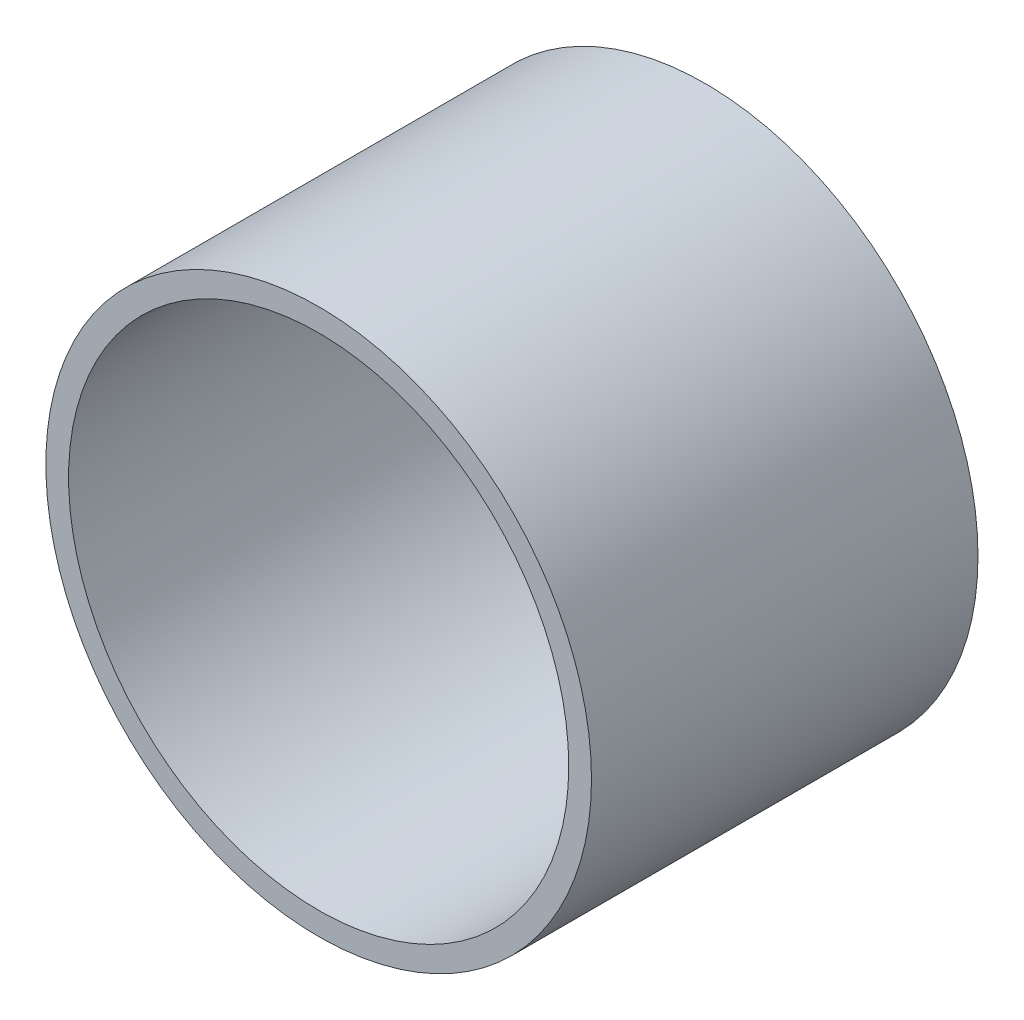
ISO-10303-21;
HEADER;
FILE_DESCRIPTION(('STEP AP214'),'2;1');
FILE_NAME('part.step','',(''),(''),'','','');
FILE_SCHEMA(('AUTOMOTIVE_DESIGN { 1 0 10303 214 1 1 1 1 }'));
ENDSEC;
DATA;
#1=APPLICATION_CONTEXT('core data for automotive mechanical design processes');
#2=APPLICATION_PROTOCOL_DEFINITION('international standard','automotive_design',2000,#1);
#3=PRODUCT_CONTEXT('',#1,'mechanical');
#4=PRODUCT('Part','Part','',(#3));
#5=PRODUCT_RELATED_PRODUCT_CATEGORY('part','',(#4));
#6=PRODUCT_DEFINITION_FORMATION('','',#4);
#7=PRODUCT_DEFINITION_CONTEXT('part definition',#1,'design');
#8=PRODUCT_DEFINITION('design','',#6,#7);
#9=PRODUCT_DEFINITION_SHAPE('','',#8);
#10=(LENGTH_UNIT() NAMED_UNIT(*) SI_UNIT(.MILLI.,.METRE.));
#11=(NAMED_UNIT(*) PLANE_ANGLE_UNIT() SI_UNIT($,.RADIAN.));
#12=(NAMED_UNIT(*) SI_UNIT($,.STERADIAN.) SOLID_ANGLE_UNIT());
#13=UNCERTAINTY_MEASURE_WITH_UNIT(LENGTH_MEASURE(1.E-05),#10,'distance_accuracy_value','');
#14=(GEOMETRIC_REPRESENTATION_CONTEXT(3) GLOBAL_UNCERTAINTY_ASSIGNED_CONTEXT((#13)) GLOBAL_UNIT_ASSIGNED_CONTEXT((#10,
#11,#12)) REPRESENTATION_CONTEXT('',''));
#15=CARTESIAN_POINT('',(0.,0.,0.));
#16=DIRECTION('',(0.,0.,1.));
#17=DIRECTION('',(1.,0.,0.));
#18=AXIS2_PLACEMENT_3D('',#15,#16,#17);
#19=CARTESIAN_POINT('',(0.,0.,6.35));
#20=DIRECTION('',(0.,0.,1.));
#21=DIRECTION('',(1.,0.,0.));
#22=AXIS2_PLACEMENT_3D('',#19,#20,#21);
#23=PLANE('',#22);
#24=CARTESIAN_POINT('',(35.9210244842765,35.9210244842768,6.35));
#25=DIRECTION('',(0.,0.,1.));
#26=DIRECTION('',(1.,0.,0.));
#27=AXIS2_PLACEMENT_3D('',#24,#25,#26);
#28=CIRCLE('',#27,2.1828125);
#29=CARTESIAN_POINT('',(38.1038369842765,35.9210244842768,6.35));
#30=VERTEX_POINT('',#29);
#31=EDGE_CURVE('E150',#30,#30,#28,.T.);
#32=ORIENTED_EDGE('',*,*,#31,.F.);
#33=EDGE_LOOP('',(#32));
#34=FACE_BOUND('',#33,.T.);
#35=CARTESIAN_POINT('',(35.9210244842767,-35.9210244842765,6.35));
#36=DIRECTION('',(0.,0.,1.));
#37=DIRECTION('',(1.,0.,0.));
#38=AXIS2_PLACEMENT_3D('',#35,#36,#37);
#39=CIRCLE('',#38,2.18281250000001);
#40=CARTESIAN_POINT('',(38.1038369842767,-35.9210244842765,6.35));
#41=VERTEX_POINT('',#40);
#42=EDGE_CURVE('E142',#41,#41,#39,.T.);
#43=ORIENTED_EDGE('',*,*,#42,.F.);
#44=EDGE_LOOP('',(#43));
#45=FACE_BOUND('',#44,.T.);
#46=CARTESIAN_POINT('',(-35.9210244842765,-35.9210244842768,6.35));
#47=DIRECTION('',(0.,0.,1.));
#48=DIRECTION('',(1.,0.,0.));
#49=AXIS2_PLACEMENT_3D('',#46,#47,#48);
#50=CIRCLE('',#49,2.18281250000001);
#51=CARTESIAN_POINT('',(-33.7382119842765,-35.9210244842768,6.35));
#52=VERTEX_POINT('',#51);
#53=EDGE_CURVE('E133',#52,#52,#50,.T.);
#54=ORIENTED_EDGE('',*,*,#53,.F.);
#55=EDGE_LOOP('',(#54));
#56=FACE_BOUND('',#55,.T.);
#57=CARTESIAN_POINT('',(-35.9210244842768,35.9210244842765,6.35));
#58=DIRECTION('',(0.,0.,1.));
#59=DIRECTION('',(1.,0.,0.));
#60=AXIS2_PLACEMENT_3D('',#57,#58,#59);
#61=CIRCLE('',#60,2.18281250000001);
#62=CARTESIAN_POINT('',(-33.7382119842768,35.9210244842765,6.35));
#63=VERTEX_POINT('',#62);
#64=EDGE_CURVE('E137',#63,#63,#61,.T.);
#65=ORIENTED_EDGE('',*,*,#64,.F.);
#66=EDGE_LOOP('',(#65));
#67=FACE_BOUND('',#66,.T.);
#68=CARTESIAN_POINT('',(37.81298,0.,6.35));
#69=DIRECTION('',(0.,0.,1.));
#70=DIRECTION('',(1.,0.,0.));
#71=AXIS2_PLACEMENT_3D('',#68,#69,#70);
#72=CIRCLE('',#71,2.1828125);
#73=CARTESIAN_POINT('',(39.9957925,0.,6.35));
#74=VERTEX_POINT('',#73);
#75=EDGE_CURVE('E170',#74,#74,#72,.T.);
#76=ORIENTED_EDGE('',*,*,#75,.F.);
#77=EDGE_LOOP('',(#76));
#78=FACE_BOUND('',#77,.T.);
#79=CARTESIAN_POINT('',(0.,37.81298,6.35));
#80=DIRECTION('',(0.,0.,1.));
#81=DIRECTION('',(1.,0.,0.));
#82=AXIS2_PLACEMENT_3D('',#79,#80,#81);
#83=CIRCLE('',#82,2.1828125);
#84=CARTESIAN_POINT('',(2.1828125,37.81298,6.35));
#85=VERTEX_POINT('',#84);
#86=EDGE_CURVE('E174',#85,#85,#83,.T.);
#87=ORIENTED_EDGE('',*,*,#86,.F.);
#88=EDGE_LOOP('',(#87));
#89=FACE_BOUND('',#88,.T.);
#90=CARTESIAN_POINT('',(-37.81298,0.,6.35));
#91=DIRECTION('',(0.,0.,1.));
#92=DIRECTION('',(1.,0.,0.));
#93=AXIS2_PLACEMENT_3D('',#90,#91,#92);
#94=CIRCLE('',#93,2.1828125);
#95=CARTESIAN_POINT('',(-35.6301675,0.,6.35));
#96=VERTEX_POINT('',#95);
#97=EDGE_CURVE('E182',#96,#96,#94,.T.);
#98=ORIENTED_EDGE('',*,*,#97,.F.);
#99=EDGE_LOOP('',(#98));
#100=FACE_BOUND('',#99,.T.);
#101=CARTESIAN_POINT('',(0.,-37.81298,6.35));
#102=DIRECTION('',(0.,0.,1.));
#103=DIRECTION('',(1.,0.,0.));
#104=AXIS2_PLACEMENT_3D('',#101,#102,#103);
#105=CIRCLE('',#104,2.1828125);
#106=CARTESIAN_POINT('',(2.1828125,-37.81298,6.35));
#107=VERTEX_POINT('',#106);
#108=EDGE_CURVE('E190',#107,#107,#105,.T.);
#109=ORIENTED_EDGE('',*,*,#108,.F.);
#110=EDGE_LOOP('',(#109));
#111=FACE_BOUND('',#110,.T.);
#112=CARTESIAN_POINT('',(0.,0.,6.34999999999999));
#113=DIRECTION('',(0.,0.,1.));
#114=DIRECTION('',(1.,0.,0.));
#115=AXIS2_PLACEMENT_3D('',#112,#113,#114);
#116=CIRCLE('',#115,69.85);
#117=CARTESIAN_POINT('',(69.85,0.,6.34999999999999));
#118=VERTEX_POINT('',#117);
#119=EDGE_CURVE('E11',#118,#118,#116,.T.);
#120=ORIENTED_EDGE('',*,*,#119,.T.);
#121=EDGE_LOOP('',(#120));
#122=FACE_BOUND('',#121,.T.);
#123=DIRECTION('',(1.,0.,0.));
#124=VECTOR('',#123,1.);
#125=CARTESIAN_POINT('',(-19.05,-19.05,6.35));
#126=LINE('',#125,#124);
#127=CARTESIAN_POINT('',(-19.05,-19.05,6.35));
#128=VERTEX_POINT('',#127);
#129=CARTESIAN_POINT('',(19.05,-19.05,6.35));
#130=VERTEX_POINT('',#129);
#131=EDGE_CURVE('E101',#128,#130,#126,.T.);
#132=ORIENTED_EDGE('',*,*,#131,.F.);
#133=DIRECTION('',(0.,-1.,0.));
#134=VECTOR('',#133,1.);
#135=CARTESIAN_POINT('',(-19.05,19.05,6.35));
#136=LINE('',#135,#134);
#137=CARTESIAN_POINT('',(-19.05,19.05,6.35));
#138=VERTEX_POINT('',#137);
#139=EDGE_CURVE('E115',#138,#128,#136,.T.);
#140=ORIENTED_EDGE('',*,*,#139,.F.);
#141=DIRECTION('',(-1.,0.,0.));
#142=VECTOR('',#141,1.);
#143=CARTESIAN_POINT('',(-19.05,19.05,6.35));
#144=LINE('',#143,#142);
#145=CARTESIAN_POINT('',(19.05,19.05,6.35));
#146=VERTEX_POINT('',#145);
#147=EDGE_CURVE('E81',#146,#138,#144,.T.);
#148=ORIENTED_EDGE('',*,*,#147,.F.);
#149=DIRECTION('',(0.,1.,0.));
#150=VECTOR('',#149,1.);
#151=CARTESIAN_POINT('',(19.05,19.05,6.35));
#152=LINE('',#151,#150);
#153=EDGE_CURVE('E121',#130,#146,#152,.T.);
#154=ORIENTED_EDGE('',*,*,#153,.F.);
#155=EDGE_LOOP('',(#132,#140,#148,#154));
#156=FACE_BOUND('',#155,.T.);
#157=ADVANCED_FACE('F43',(#34,#45,#56,#67,#78,#89,#100,#111,#122,#156),#23,.T.);
#158=CARTESIAN_POINT('',(0.,0.,107.95));
#159=DIRECTION('',(0.,0.,1.));
#160=DIRECTION('',(1.,0.,0.));
#161=AXIS2_PLACEMENT_3D('',#158,#159,#160);
#162=PLANE('',#161);
#163=CARTESIAN_POINT('',(0.,0.,107.95));
#164=DIRECTION('',(0.,0.,1.));
#165=DIRECTION('',(1.,0.,0.));
#166=AXIS2_PLACEMENT_3D('',#163,#164,#165);
#167=CIRCLE('',#166,76.2);
#168=CARTESIAN_POINT('',(76.2,0.,107.95));
#169=VERTEX_POINT('',#168);
#170=EDGE_CURVE('E52',#169,#169,#167,.T.);
#171=ORIENTED_EDGE('',*,*,#170,.T.);
#172=EDGE_LOOP('',(#171));
#173=FACE_BOUND('',#172,.T.);
#174=CARTESIAN_POINT('',(0.,0.,107.95));
#175=DIRECTION('',(0.,0.,1.));
#176=DIRECTION('',(1.,0.,0.));
#177=AXIS2_PLACEMENT_3D('',#174,#175,#176);
#178=CIRCLE('',#177,69.85);
#179=CARTESIAN_POINT('',(69.85,0.,107.95));
#180=VERTEX_POINT('',#179);
#181=EDGE_CURVE('E169',#180,#180,#178,.T.);
#182=ORIENTED_EDGE('',*,*,#181,.F.);
#183=EDGE_LOOP('',(#182));
#184=FACE_BOUND('',#183,.T.);
#185=ADVANCED_FACE('F210',(#173,#184),#162,.T.);
#186=CARTESIAN_POINT('',(0.,0.,0.));
#187=DIRECTION('',(0.,0.,1.));
#188=DIRECTION('',(1.,0.,0.));
#189=AXIS2_PLACEMENT_3D('',#186,#187,#188);
#190=PLANE('',#189);
#191=CARTESIAN_POINT('',(35.9210244842765,35.9210244842768,0.));
#192=DIRECTION('',(0.,0.,1.));
#193=DIRECTION('',(1.,0.,0.));
#194=AXIS2_PLACEMENT_3D('',#191,#192,#193);
#195=CIRCLE('',#194,2.1828125);
#196=CARTESIAN_POINT('',(38.1038369842765,35.9210244842768,0.));
#197=VERTEX_POINT('',#196);
#198=EDGE_CURVE('E132',#197,#197,#195,.T.);
#199=ORIENTED_EDGE('',*,*,#198,.T.);
#200=EDGE_LOOP('',(#199));
#201=FACE_BOUND('',#200,.T.);
#202=CARTESIAN_POINT('',(35.9210244842767,-35.9210244842765,0.));
#203=DIRECTION('',(0.,0.,1.));
#204=DIRECTION('',(1.,0.,0.));
#205=AXIS2_PLACEMENT_3D('',#202,#203,#204);
#206=CIRCLE('',#205,2.18281250000001);
#207=CARTESIAN_POINT('',(38.1038369842767,-35.9210244842765,0.));
#208=VERTEX_POINT('',#207);
#209=EDGE_CURVE('E146',#208,#208,#206,.T.);
#210=ORIENTED_EDGE('',*,*,#209,.T.);
#211=EDGE_LOOP('',(#210));
#212=FACE_BOUND('',#211,.T.);
#213=CARTESIAN_POINT('',(-35.9210244842765,-35.9210244842768,0.));
#214=DIRECTION('',(0.,0.,1.));
#215=DIRECTION('',(1.,0.,0.));
#216=AXIS2_PLACEMENT_3D('',#213,#214,#215);
#217=CIRCLE('',#216,2.18281250000001);
#218=CARTESIAN_POINT('',(-33.7382119842765,-35.9210244842768,0.));
#219=VERTEX_POINT('',#218);
#220=EDGE_CURVE('E138',#219,#219,#217,.T.);
#221=ORIENTED_EDGE('',*,*,#220,.T.);
#222=EDGE_LOOP('',(#221));
#223=FACE_BOUND('',#222,.T.);
#224=CARTESIAN_POINT('',(-35.9210244842768,35.9210244842765,0.));
#225=DIRECTION('',(0.,0.,1.));
#226=DIRECTION('',(1.,0.,0.));
#227=AXIS2_PLACEMENT_3D('',#224,#225,#226);
#228=CIRCLE('',#227,2.18281250000001);
#229=CARTESIAN_POINT('',(-33.7382119842768,35.9210244842765,0.));
#230=VERTEX_POINT('',#229);
#231=EDGE_CURVE('E157',#230,#230,#228,.T.);
#232=ORIENTED_EDGE('',*,*,#231,.T.);
#233=EDGE_LOOP('',(#232));
#234=FACE_BOUND('',#233,.T.);
#235=CARTESIAN_POINT('',(37.81298,0.,0.));
#236=DIRECTION('',(0.,0.,1.));
#237=DIRECTION('',(1.,0.,0.));
#238=AXIS2_PLACEMENT_3D('',#235,#236,#237);
#239=CIRCLE('',#238,2.1828125);
#240=CARTESIAN_POINT('',(39.9957925,0.,0.));
#241=VERTEX_POINT('',#240);
#242=EDGE_CURVE('E165',#241,#241,#239,.T.);
#243=ORIENTED_EDGE('',*,*,#242,.T.);
#244=EDGE_LOOP('',(#243));
#245=FACE_BOUND('',#244,.T.);
#246=CARTESIAN_POINT('',(0.,37.81298,0.));
#247=DIRECTION('',(0.,0.,1.));
#248=DIRECTION('',(1.,0.,0.));
#249=AXIS2_PLACEMENT_3D('',#246,#247,#248);
#250=CIRCLE('',#249,2.1828125);
#251=CARTESIAN_POINT('',(2.1828125,37.81298,0.));
#252=VERTEX_POINT('',#251);
#253=EDGE_CURVE('E178',#252,#252,#250,.T.);
#254=ORIENTED_EDGE('',*,*,#253,.T.);
#255=EDGE_LOOP('',(#254));
#256=FACE_BOUND('',#255,.T.);
#257=CARTESIAN_POINT('',(-37.81298,0.,0.));
#258=DIRECTION('',(0.,0.,1.));
#259=DIRECTION('',(1.,0.,0.));
#260=AXIS2_PLACEMENT_3D('',#257,#258,#259);
#261=CIRCLE('',#260,2.1828125);
#262=CARTESIAN_POINT('',(-35.6301675,0.,0.));
#263=VERTEX_POINT('',#262);
#264=EDGE_CURVE('E186',#263,#263,#261,.T.);
#265=ORIENTED_EDGE('',*,*,#264,.T.);
#266=EDGE_LOOP('',(#265));
#267=FACE_BOUND('',#266,.T.);
#268=CARTESIAN_POINT('',(0.,-37.81298,0.));
#269=DIRECTION('',(0.,0.,1.));
#270=DIRECTION('',(1.,0.,0.));
#271=AXIS2_PLACEMENT_3D('',#268,#269,#270);
#272=CIRCLE('',#271,2.1828125);
#273=CARTESIAN_POINT('',(2.1828125,-37.81298,0.));
#274=VERTEX_POINT('',#273);
#275=EDGE_CURVE('E161',#274,#274,#272,.T.);
#276=ORIENTED_EDGE('',*,*,#275,.T.);
#277=EDGE_LOOP('',(#276));
#278=FACE_BOUND('',#277,.T.);
#279=CARTESIAN_POINT('',(0.,0.,0.));
#280=DIRECTION('',(0.,0.,1.));
#281=DIRECTION('',(1.,0.,0.));
#282=AXIS2_PLACEMENT_3D('',#279,#280,#281);
#283=CIRCLE('',#282,76.2);
#284=CARTESIAN_POINT('',(76.2,0.,0.));
#285=VERTEX_POINT('',#284);
#286=EDGE_CURVE('E200',#285,#285,#283,.T.);
#287=ORIENTED_EDGE('',*,*,#286,.F.);
#288=EDGE_LOOP('',(#287));
#289=FACE_BOUND('',#288,.T.);
#290=ADVANCED_FACE('F208',(#201,#212,#223,#234,#245,#256,#267,#278,#289),#190,.F.);
#291=CARTESIAN_POINT('',(0.,0.,107.95));
#292=DIRECTION('',(0.,0.,-1.));
#293=DIRECTION('',(-1.,0.,0.));
#294=AXIS2_PLACEMENT_3D('',#291,#292,#293);
#295=CYLINDRICAL_SURFACE('',#294,76.2);
#296=ORIENTED_EDGE('',*,*,#170,.F.);
#297=EDGE_LOOP('',(#296));
#298=FACE_BOUND('',#297,.T.);
#299=ORIENTED_EDGE('',*,*,#286,.T.);
#300=EDGE_LOOP('',(#299));
#301=FACE_BOUND('',#300,.T.);
#302=ADVANCED_FACE('F45',(#298,#301),#295,.T.);
#303=CARTESIAN_POINT('',(0.,0.,107.95));
#304=DIRECTION('',(0.,0.,-1.));
#305=DIRECTION('',(-1.,0.,0.));
#306=AXIS2_PLACEMENT_3D('',#303,#304,#305);
#307=CYLINDRICAL_SURFACE('',#306,69.85);
#308=ORIENTED_EDGE('',*,*,#119,.F.);
#309=EDGE_LOOP('',(#308));
#310=FACE_BOUND('',#309,.T.);
#311=ORIENTED_EDGE('',*,*,#181,.T.);
#312=EDGE_LOOP('',(#311));
#313=FACE_BOUND('',#312,.T.);
#314=ADVANCED_FACE('F216',(#310,#313),#307,.F.);
#315=CARTESIAN_POINT('',(0.,-37.81298,0.));
#316=DIRECTION('',(0.,0.,1.));
#317=DIRECTION('',(1.,0.,0.));
#318=AXIS2_PLACEMENT_3D('',#315,#316,#317);
#319=CYLINDRICAL_SURFACE('',#318,2.1828125);
#320=ORIENTED_EDGE('',*,*,#275,.F.);
#321=EDGE_LOOP('',(#320));
#322=FACE_BOUND('',#321,.T.);
#323=ORIENTED_EDGE('',*,*,#108,.T.);
#324=EDGE_LOOP('',(#323));
#325=FACE_BOUND('',#324,.T.);
#326=ADVANCED_FACE('F230',(#322,#325),#319,.F.);
#327=CARTESIAN_POINT('',(-37.81298,0.,0.));
#328=DIRECTION('',(0.,0.,1.));
#329=DIRECTION('',(1.,0.,0.));
#330=AXIS2_PLACEMENT_3D('',#327,#328,#329);
#331=CYLINDRICAL_SURFACE('',#330,2.1828125);
#332=ORIENTED_EDGE('',*,*,#264,.F.);
#333=EDGE_LOOP('',(#332));
#334=FACE_BOUND('',#333,.T.);
#335=ORIENTED_EDGE('',*,*,#97,.T.);
#336=EDGE_LOOP('',(#335));
#337=FACE_BOUND('',#336,.T.);
#338=ADVANCED_FACE('F237',(#334,#337),#331,.F.);
#339=CARTESIAN_POINT('',(0.,37.81298,0.));
#340=DIRECTION('',(0.,0.,1.));
#341=DIRECTION('',(1.,0.,0.));
#342=AXIS2_PLACEMENT_3D('',#339,#340,#341);
#343=CYLINDRICAL_SURFACE('',#342,2.1828125);
#344=ORIENTED_EDGE('',*,*,#253,.F.);
#345=EDGE_LOOP('',(#344));
#346=FACE_BOUND('',#345,.T.);
#347=ORIENTED_EDGE('',*,*,#86,.T.);
#348=EDGE_LOOP('',(#347));
#349=FACE_BOUND('',#348,.T.);
#350=ADVANCED_FACE('F281',(#346,#349),#343,.F.);
#351=CARTESIAN_POINT('',(37.81298,0.,0.));
#352=DIRECTION('',(0.,0.,1.));
#353=DIRECTION('',(1.,0.,0.));
#354=AXIS2_PLACEMENT_3D('',#351,#352,#353);
#355=CYLINDRICAL_SURFACE('',#354,2.1828125);
#356=ORIENTED_EDGE('',*,*,#242,.F.);
#357=EDGE_LOOP('',(#356));
#358=FACE_BOUND('',#357,.T.);
#359=ORIENTED_EDGE('',*,*,#75,.T.);
#360=EDGE_LOOP('',(#359));
#361=FACE_BOUND('',#360,.T.);
#362=ADVANCED_FACE('F277',(#358,#361),#355,.F.);
#363=CARTESIAN_POINT('',(-35.9210244842768,35.9210244842765,0.));
#364=DIRECTION('',(0.,0.,1.));
#365=DIRECTION('',(1.,0.,0.));
#366=AXIS2_PLACEMENT_3D('',#363,#364,#365);
#367=CYLINDRICAL_SURFACE('',#366,2.18281250000001);
#368=ORIENTED_EDGE('',*,*,#231,.F.);
#369=EDGE_LOOP('',(#368));
#370=FACE_BOUND('',#369,.T.);
#371=ORIENTED_EDGE('',*,*,#64,.T.);
#372=EDGE_LOOP('',(#371));
#373=FACE_BOUND('',#372,.T.);
#374=ADVANCED_FACE('F267',(#370,#373),#367,.F.);
#375=CARTESIAN_POINT('',(-35.9210244842765,-35.9210244842768,0.));
#376=DIRECTION('',(0.,0.,1.));
#377=DIRECTION('',(1.,0.,0.));
#378=AXIS2_PLACEMENT_3D('',#375,#376,#377);
#379=CYLINDRICAL_SURFACE('',#378,2.18281250000001);
#380=ORIENTED_EDGE('',*,*,#220,.F.);
#381=EDGE_LOOP('',(#380));
#382=FACE_BOUND('',#381,.T.);
#383=ORIENTED_EDGE('',*,*,#53,.T.);
#384=EDGE_LOOP('',(#383));
#385=FACE_BOUND('',#384,.T.);
#386=ADVANCED_FACE('F263',(#382,#385),#379,.F.);
#387=CARTESIAN_POINT('',(35.9210244842767,-35.9210244842765,0.));
#388=DIRECTION('',(0.,0.,1.));
#389=DIRECTION('',(1.,0.,0.));
#390=AXIS2_PLACEMENT_3D('',#387,#388,#389);
#391=CYLINDRICAL_SURFACE('',#390,2.18281250000001);
#392=ORIENTED_EDGE('',*,*,#209,.F.);
#393=EDGE_LOOP('',(#392));
#394=FACE_BOUND('',#393,.T.);
#395=ORIENTED_EDGE('',*,*,#42,.T.);
#396=EDGE_LOOP('',(#395));
#397=FACE_BOUND('',#396,.T.);
#398=ADVANCED_FACE('F266',(#394,#397),#391,.F.);
#399=CARTESIAN_POINT('',(35.9210244842765,35.9210244842768,0.));
#400=DIRECTION('',(0.,0.,1.));
#401=DIRECTION('',(1.,0.,0.));
#402=AXIS2_PLACEMENT_3D('',#399,#400,#401);
#403=CYLINDRICAL_SURFACE('',#402,2.1828125);
#404=ORIENTED_EDGE('',*,*,#198,.F.);
#405=EDGE_LOOP('',(#404));
#406=FACE_BOUND('',#405,.T.);
#407=ORIENTED_EDGE('',*,*,#31,.T.);
#408=EDGE_LOOP('',(#407));
#409=FACE_BOUND('',#408,.T.);
#410=ADVANCED_FACE('F262',(#406,#409),#403,.F.);
#411=CARTESIAN_POINT('',(-19.05,19.05,25.4));
#412=DIRECTION('',(1.,0.,0.));
#413=DIRECTION('',(0.,1.,0.));
#414=AXIS2_PLACEMENT_3D('',#411,#412,#413);
#415=PLANE('',#414);
#416=ORIENTED_EDGE('',*,*,#139,.T.);
#417=DIRECTION('',(0.,0.,-1.));
#418=VECTOR('',#417,1.);
#419=CARTESIAN_POINT('',(-19.05,-19.05,25.4));
#420=LINE('',#419,#418);
#421=CARTESIAN_POINT('',(-19.05,-19.05,25.4));
#422=VERTEX_POINT('',#421);
#423=EDGE_CURVE('E105',#422,#128,#420,.T.);
#424=ORIENTED_EDGE('',*,*,#423,.F.);
#425=DIRECTION('',(0.,-1.,0.));
#426=VECTOR('',#425,1.);
#427=CARTESIAN_POINT('',(-19.05,19.05,25.4));
#428=LINE('',#427,#426);
#429=CARTESIAN_POINT('',(-19.05,19.05,25.4));
#430=VERTEX_POINT('',#429);
#431=EDGE_CURVE('E93',#430,#422,#428,.T.);
#432=ORIENTED_EDGE('',*,*,#431,.F.);
#433=DIRECTION('',(0.,0.,-1.));
#434=VECTOR('',#433,1.);
#435=CARTESIAN_POINT('',(-19.05,19.05,25.4));
#436=LINE('',#435,#434);
#437=EDGE_CURVE('E111',#430,#138,#436,.T.);
#438=ORIENTED_EDGE('',*,*,#437,.T.);
#439=EDGE_LOOP('',(#416,#424,#432,#438));
#440=FACE_BOUND('',#439,.T.);
#441=ADVANCED_FACE('F247',(#440),#415,.F.);
#442=CARTESIAN_POINT('',(-19.05,-19.05,25.4));
#443=DIRECTION('',(0.,1.,0.));
#444=DIRECTION('',(0.,0.,1.));
#445=AXIS2_PLACEMENT_3D('',#442,#443,#444);
#446=PLANE('',#445);
#447=ORIENTED_EDGE('',*,*,#131,.T.);
#448=DIRECTION('',(0.,0.,-1.));
#449=VECTOR('',#448,1.);
#450=CARTESIAN_POINT('',(19.05,-19.05,25.4));
#451=LINE('',#450,#449);
#452=CARTESIAN_POINT('',(19.05,-19.05,25.4));
#453=VERTEX_POINT('',#452);
#454=EDGE_CURVE('E98',#453,#130,#451,.T.);
#455=ORIENTED_EDGE('',*,*,#454,.F.);
#456=DIRECTION('',(1.,0.,0.));
#457=VECTOR('',#456,1.);
#458=CARTESIAN_POINT('',(-19.05,-19.05,25.4));
#459=LINE('',#458,#457);
#460=EDGE_CURVE('E88',#422,#453,#459,.T.);
#461=ORIENTED_EDGE('',*,*,#460,.F.);
#462=ORIENTED_EDGE('',*,*,#423,.T.);
#463=EDGE_LOOP('',(#447,#455,#461,#462));
#464=FACE_BOUND('',#463,.T.);
#465=ADVANCED_FACE('F99',(#464),#446,.F.);
#466=CARTESIAN_POINT('',(19.05,19.05,25.4));
#467=DIRECTION('',(-1.,0.,0.));
#468=DIRECTION('',(0.,0.,1.));
#469=AXIS2_PLACEMENT_3D('',#466,#467,#468);
#470=PLANE('',#469);
#471=ORIENTED_EDGE('',*,*,#153,.T.);
#472=DIRECTION('',(0.,0.,-1.));
#473=VECTOR('',#472,1.);
#474=CARTESIAN_POINT('',(19.05,19.05,25.4));
#475=LINE('',#474,#473);
#476=CARTESIAN_POINT('',(19.05,19.05,25.4));
#477=VERTEX_POINT('',#476);
#478=EDGE_CURVE('E59',#477,#146,#475,.T.);
#479=ORIENTED_EDGE('',*,*,#478,.F.);
#480=DIRECTION('',(0.,1.,0.));
#481=VECTOR('',#480,1.);
#482=CARTESIAN_POINT('',(19.05,19.05,25.4));
#483=LINE('',#482,#481);
#484=EDGE_CURVE('E91',#453,#477,#483,.T.);
#485=ORIENTED_EDGE('',*,*,#484,.F.);
#486=ORIENTED_EDGE('',*,*,#454,.T.);
#487=EDGE_LOOP('',(#471,#479,#485,#486));
#488=FACE_BOUND('',#487,.T.);
#489=ADVANCED_FACE('F107',(#488),#470,.F.);
#490=CARTESIAN_POINT('',(-19.05,19.05,25.4));
#491=DIRECTION('',(0.,-1.,0.));
#492=DIRECTION('',(0.,0.,-1.));
#493=AXIS2_PLACEMENT_3D('',#490,#491,#492);
#494=PLANE('',#493);
#495=ORIENTED_EDGE('',*,*,#147,.T.);
#496=ORIENTED_EDGE('',*,*,#437,.F.);
#497=DIRECTION('',(-1.,0.,0.));
#498=VECTOR('',#497,1.);
#499=CARTESIAN_POINT('',(-19.05,19.05,25.4));
#500=LINE('',#499,#498);
#501=EDGE_CURVE('E67',#477,#430,#500,.T.);
#502=ORIENTED_EDGE('',*,*,#501,.F.);
#503=ORIENTED_EDGE('',*,*,#478,.T.);
#504=EDGE_LOOP('',(#495,#496,#502,#503));
#505=FACE_BOUND('',#504,.T.);
#506=ADVANCED_FACE('F248',(#505),#494,.F.);
#507=CARTESIAN_POINT('',(0.,0.,25.4));
#508=DIRECTION('',(0.,0.,1.));
#509=DIRECTION('',(1.,0.,0.));
#510=AXIS2_PLACEMENT_3D('',#507,#508,#509);
#511=PLANE('',#510);
#512=ORIENTED_EDGE('',*,*,#431,.T.);
#513=ORIENTED_EDGE('',*,*,#460,.T.);
#514=ORIENTED_EDGE('',*,*,#484,.T.);
#515=ORIENTED_EDGE('',*,*,#501,.T.);
#516=EDGE_LOOP('',(#512,#513,#514,#515));
#517=FACE_BOUND('',#516,.T.);
#518=ADVANCED_FACE('F89',(#517),#511,.T.);
#519=CLOSED_SHELL('',(#157,#185,#290,#302,#314,#326,#338,#350,#362,#374,#386,#398,#410,#441,
#465,#489,#506,#518));
#520=MANIFOLD_SOLID_BREP('B2',#519);
#521=ADVANCED_BREP_SHAPE_REPRESENTATION('',(#18,#520),#14);
#522=SHAPE_DEFINITION_REPRESENTATION(#9,#521);
ENDSEC;
END-ISO-10303-21;
